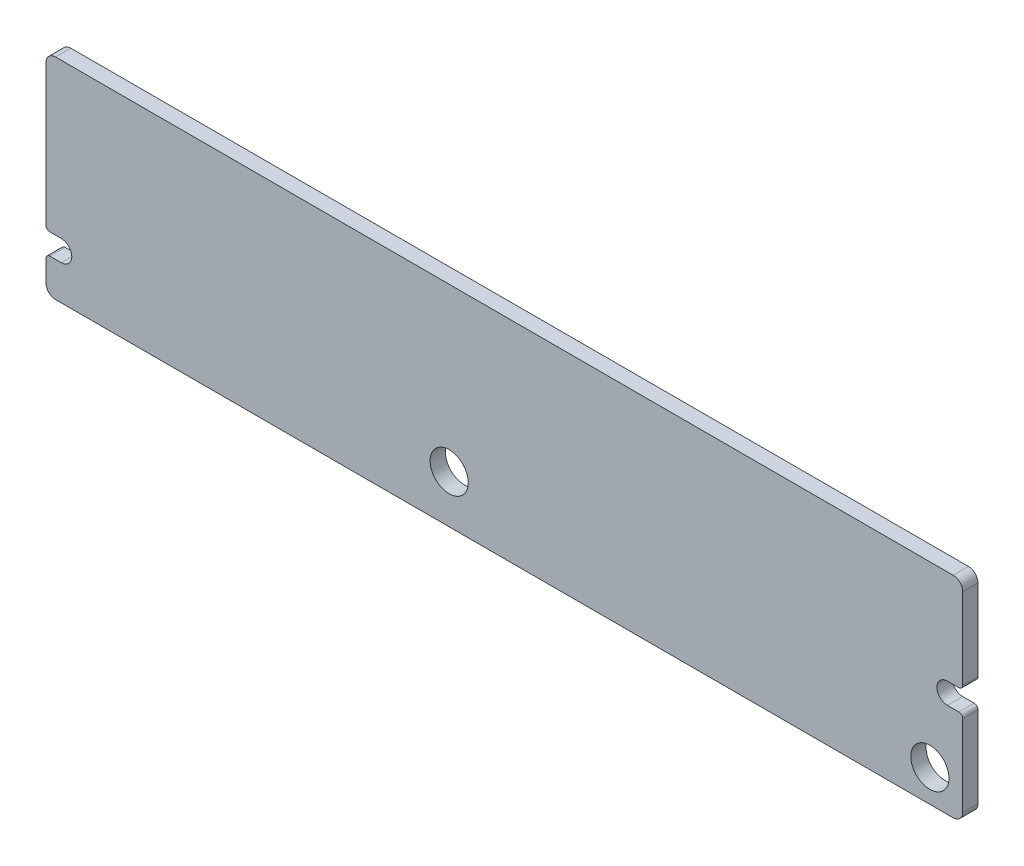
ISO-10303-21;
HEADER;
FILE_DESCRIPTION(('STEP AP214'),'2;1');
FILE_NAME('part.step','',(''),(''),'','','');
FILE_SCHEMA(('AUTOMOTIVE_DESIGN { 1 0 10303 214 1 1 1 1 }'));
ENDSEC;
DATA;
#1=APPLICATION_CONTEXT('core data for automotive mechanical design processes');
#2=APPLICATION_PROTOCOL_DEFINITION('international standard','automotive_design',2000,#1);
#3=PRODUCT_CONTEXT('',#1,'mechanical');
#4=PRODUCT('Part','Part','',(#3));
#5=PRODUCT_RELATED_PRODUCT_CATEGORY('part','',(#4));
#6=PRODUCT_DEFINITION_FORMATION('','',#4);
#7=PRODUCT_DEFINITION_CONTEXT('part definition',#1,'design');
#8=PRODUCT_DEFINITION('design','',#6,#7);
#9=PRODUCT_DEFINITION_SHAPE('','',#8);
#10=(LENGTH_UNIT() NAMED_UNIT(*) SI_UNIT(.MILLI.,.METRE.));
#11=(NAMED_UNIT(*) PLANE_ANGLE_UNIT() SI_UNIT($,.RADIAN.));
#12=(NAMED_UNIT(*) SI_UNIT($,.STERADIAN.) SOLID_ANGLE_UNIT());
#13=UNCERTAINTY_MEASURE_WITH_UNIT(LENGTH_MEASURE(1.E-05),#10,'distance_accuracy_value','');
#14=(GEOMETRIC_REPRESENTATION_CONTEXT(3) GLOBAL_UNCERTAINTY_ASSIGNED_CONTEXT((#13)) GLOBAL_UNIT_ASSIGNED_CONTEXT((#10,
#11,#12)) REPRESENTATION_CONTEXT('',''));
#15=CARTESIAN_POINT('',(0.,0.,0.));
#16=DIRECTION('',(0.,0.,1.));
#17=DIRECTION('',(1.,0.,0.));
#18=AXIS2_PLACEMENT_3D('',#15,#16,#17);
#19=CARTESIAN_POINT('',(-14.6,45.9499999999999,-4.46999999999998));
#20=DIRECTION('',(0.,0.,1.));
#21=DIRECTION('',(-1.,0.,0.));
#22=AXIS2_PLACEMENT_3D('',#19,#20,#21);
#23=PLANE('',#22);
#24=DIRECTION('',(-1.,0.,0.));
#25=VECTOR('',#24,1.);
#26=CARTESIAN_POINT('',(-19.8560525835406,1.02808763083835,-4.46999999999998));
#27=LINE('',#26,#25);
#28=CARTESIAN_POINT('',(-19.8560525835406,1.02808763083835,-4.46999999999998));
#29=VERTEX_POINT('',#28);
#30=CARTESIAN_POINT('',(-22.6530701818056,1.02808763083835,-4.46999999999998));
#31=VERTEX_POINT('',#30);
#32=EDGE_CURVE('E253',#29,#31,#27,.T.);
#33=ORIENTED_EDGE('',*,*,#32,.F.);
#34=DIRECTION('',(0.,-1.,0.));
#35=VECTOR('',#34,1.);
#36=CARTESIAN_POINT('',(-19.8560525835406,4.07937955621834,-4.46999999999998));
#37=LINE('',#36,#35);
#38=CARTESIAN_POINT('',(-19.8560525835406,4.07937955621834,-4.46999999999998));
#39=VERTEX_POINT('',#38);
#40=EDGE_CURVE('E284',#39,#29,#37,.T.);
#41=ORIENTED_EDGE('',*,*,#40,.F.);
#42=DIRECTION('',(-1.,0.,0.));
#43=VECTOR('',#42,1.);
#44=CARTESIAN_POINT('',(-19.8560525835406,4.07937955621834,-4.46999999999998));
#45=LINE('',#44,#43);
#46=CARTESIAN_POINT('',(-22.6530701818056,4.07937955621834,-4.46999999999998));
#47=VERTEX_POINT('',#46);
#48=EDGE_CURVE('E297',#39,#47,#45,.T.);
#49=ORIENTED_EDGE('',*,*,#48,.T.);
#50=DIRECTION('',(0.,-1.,0.));
#51=VECTOR('',#50,1.);
#52=CARTESIAN_POINT('',(-22.6530701818056,4.07937955621834,-4.46999999999998));
#53=LINE('',#52,#51);
#54=EDGE_CURVE('E295',#47,#31,#53,.T.);
#55=ORIENTED_EDGE('',*,*,#54,.T.);
#56=EDGE_LOOP('',(#33,#41,#49,#55));
#57=FACE_BOUND('',#56,.T.);
#58=CARTESIAN_POINT('',(-1.01999999999999,-0.720000000000151,-4.46999999999998));
#59=DIRECTION('',(0.,0.,-1.));
#60=DIRECTION('',(-1.,0.,0.));
#61=AXIS2_PLACEMENT_3D('',#58,#59,#60);
#62=CIRCLE('',#61,1.);
#63=CARTESIAN_POINT('',(-2.01999999999999,-0.720000000000151,-4.46999999999998));
#64=VERTEX_POINT('',#63);
#65=EDGE_CURVE('E375',#64,#64,#62,.T.);
#66=ORIENTED_EDGE('',*,*,#65,.F.);
#67=EDGE_LOOP('',(#66));
#68=FACE_BOUND('',#67,.T.);
#69=CARTESIAN_POINT('',(-26.19,0.0999999999998502,-4.46999999999998));
#70=DIRECTION('',(0.,0.,-1.));
#71=DIRECTION('',(-1.,0.,0.));
#72=AXIS2_PLACEMENT_3D('',#69,#70,#71);
#73=CIRCLE('',#72,1.);
#74=CARTESIAN_POINT('',(-27.19,0.0999999999998502,-4.46999999999998));
#75=VERTEX_POINT('',#74);
#76=EDGE_CURVE('E51',#75,#75,#73,.T.);
#77=ORIENTED_EDGE('',*,*,#76,.F.);
#78=EDGE_LOOP('',(#77));
#79=FACE_BOUND('',#78,.T.);
#80=DIRECTION('',(0.,-1.,0.));
#81=VECTOR('',#80,1.);
#82=CARTESIAN_POINT('',(-47.3,8.09999999999985,-4.46999999999998));
#83=LINE('',#82,#81);
#84=CARTESIAN_POINT('',(-47.3,8.09999999999985,-4.47));
#85=VERTEX_POINT('',#84);
#86=CARTESIAN_POINT('',(-47.3,0.719999999999853,-4.47));
#87=VERTEX_POINT('',#86);
#88=EDGE_CURVE('E459',#85,#87,#83,.T.);
#89=ORIENTED_EDGE('',*,*,#88,.F.);
#90=CARTESIAN_POINT('',(-46.8,8.09999999999985,-4.46999999999998));
#91=DIRECTION('',(0.,0.,-1.));
#92=DIRECTION('',(-1.,0.,0.));
#93=AXIS2_PLACEMENT_3D('',#90,#91,#92);
#94=CIRCLE('',#93,0.5);
#95=CARTESIAN_POINT('',(-46.8,8.59999999999985,-4.47));
#96=VERTEX_POINT('',#95);
#97=EDGE_CURVE('E312',#85,#96,#94,.T.);
#98=ORIENTED_EDGE('',*,*,#97,.T.);
#99=DIRECTION('',(-1.,0.,0.));
#100=VECTOR('',#99,1.);
#101=CARTESIAN_POINT('',(0.200000000000013,8.59999999999985,-4.46999999999998));
#102=LINE('',#101,#100);
#103=CARTESIAN_POINT('',(0.200000000000013,8.59999999999985,-4.47));
#104=VERTEX_POINT('',#103);
#105=EDGE_CURVE('E451',#104,#96,#102,.T.);
#106=ORIENTED_EDGE('',*,*,#105,.F.);
#107=CARTESIAN_POINT('',(0.200000000000013,8.09999999999985,-4.46999999999998));
#108=DIRECTION('',(0.,0.,-1.));
#109=DIRECTION('',(0.,1.,0.));
#110=AXIS2_PLACEMENT_3D('',#107,#108,#109);
#111=CIRCLE('',#110,0.5);
#112=CARTESIAN_POINT('',(0.700000000000011,8.09999999999985,-4.47));
#113=VERTEX_POINT('',#112);
#114=EDGE_CURVE('E442',#104,#113,#111,.T.);
#115=ORIENTED_EDGE('',*,*,#114,.T.);
#116=DIRECTION('',(0.,1.,0.));
#117=VECTOR('',#116,1.);
#118=CARTESIAN_POINT('',(0.700000000000011,3.84999999999985,-4.46999999999998));
#119=LINE('',#118,#117);
#120=CARTESIAN_POINT('',(0.700000000000011,3.84999999999985,-4.47));
#121=VERTEX_POINT('',#120);
#122=EDGE_CURVE('E443',#121,#113,#119,.T.);
#123=ORIENTED_EDGE('',*,*,#122,.F.);
#124=CARTESIAN_POINT('',(0.500000000000013,3.84999999999985,-4.46999999999998));
#125=DIRECTION('',(0.,0.,-1.));
#126=DIRECTION('',(1.,0.,0.));
#127=AXIS2_PLACEMENT_3D('',#124,#125,#126);
#128=CIRCLE('',#127,0.2);
#129=CARTESIAN_POINT('',(0.500000000000013,3.64999999999985,-4.47));
#130=VERTEX_POINT('',#129);
#131=EDGE_CURVE('E425',#121,#130,#128,.T.);
#132=ORIENTED_EDGE('',*,*,#131,.T.);
#133=DIRECTION('',(1.,0.,0.));
#134=VECTOR('',#133,1.);
#135=CARTESIAN_POINT('',(-0.0999999999999873,3.64999999999985,-4.46999999999998));
#136=LINE('',#135,#134);
#137=CARTESIAN_POINT('',(-0.0999999999999872,3.64999999999985,-4.47));
#138=VERTEX_POINT('',#137);
#139=EDGE_CURVE('E435',#138,#130,#136,.T.);
#140=ORIENTED_EDGE('',*,*,#139,.F.);
#141=CARTESIAN_POINT('',(-0.0999999999999873,3.09999999999985,-4.46999999999998));
#142=DIRECTION('',(0.,0.,-1.));
#143=DIRECTION('',(0.,-1.,0.));
#144=AXIS2_PLACEMENT_3D('',#141,#142,#143);
#145=CIRCLE('',#144,0.55);
#146=CARTESIAN_POINT('',(-0.0999999999999873,2.54999999999985,-4.47));
#147=VERTEX_POINT('',#146);
#148=EDGE_CURVE('E431',#147,#138,#145,.T.);
#149=ORIENTED_EDGE('',*,*,#148,.F.);
#150=DIRECTION('',(-1.,0.,0.));
#151=VECTOR('',#150,1.);
#152=CARTESIAN_POINT('',(0.500000000000013,2.54999999999985,-4.46999999999998));
#153=LINE('',#152,#151);
#154=CARTESIAN_POINT('',(0.500000000000013,2.54999999999985,-4.47));
#155=VERTEX_POINT('',#154);
#156=EDGE_CURVE('E426',#155,#147,#153,.T.);
#157=ORIENTED_EDGE('',*,*,#156,.F.);
#158=CARTESIAN_POINT('',(0.500000000000013,2.34999999999985,-4.46999999999998));
#159=DIRECTION('',(0.,0.,-1.));
#160=DIRECTION('',(0.,1.,0.));
#161=AXIS2_PLACEMENT_3D('',#158,#159,#160);
#162=CIRCLE('',#161,0.2);
#163=CARTESIAN_POINT('',(0.700000000000011,2.34999999999985,-4.47));
#164=VERTEX_POINT('',#163);
#165=EDGE_CURVE('E416',#155,#164,#162,.T.);
#166=ORIENTED_EDGE('',*,*,#165,.T.);
#167=DIRECTION('',(0.,1.,0.));
#168=VECTOR('',#167,1.);
#169=CARTESIAN_POINT('',(0.700000000000011,-1.90000000000014,-4.46999999999998));
#170=LINE('',#169,#168);
#171=CARTESIAN_POINT('',(0.700000000000012,-1.90000000000014,-4.47));
#172=VERTEX_POINT('',#171);
#173=EDGE_CURVE('E417',#172,#164,#170,.T.);
#174=ORIENTED_EDGE('',*,*,#173,.F.);
#175=CARTESIAN_POINT('',(0.200000000000013,-1.90000000000014,-4.46999999999998));
#176=DIRECTION('',(0.,0.,-1.));
#177=DIRECTION('',(1.,0.,0.));
#178=AXIS2_PLACEMENT_3D('',#175,#176,#177);
#179=CIRCLE('',#178,0.5);
#180=CARTESIAN_POINT('',(0.200000000000013,-2.40000000000015,-4.47));
#181=VERTEX_POINT('',#180);
#182=EDGE_CURVE('E407',#172,#181,#179,.T.);
#183=ORIENTED_EDGE('',*,*,#182,.T.);
#184=DIRECTION('',(1.,0.,0.));
#185=VECTOR('',#184,1.);
#186=CARTESIAN_POINT('',(-46.8,-2.40000000000015,-4.46999999999998));
#187=LINE('',#186,#185);
#188=CARTESIAN_POINT('',(-46.8,-2.40000000000015,-4.47));
#189=VERTEX_POINT('',#188);
#190=EDGE_CURVE('E408',#189,#181,#187,.T.);
#191=ORIENTED_EDGE('',*,*,#190,.F.);
#192=CARTESIAN_POINT('',(-46.8,-1.90000000000014,-4.46999999999998));
#193=DIRECTION('',(0.,0.,-1.));
#194=DIRECTION('',(0.,-1.,0.));
#195=AXIS2_PLACEMENT_3D('',#192,#193,#194);
#196=CIRCLE('',#195,0.5);
#197=CARTESIAN_POINT('',(-47.3,-1.90000000000014,-4.47));
#198=VERTEX_POINT('',#197);
#199=EDGE_CURVE('E398',#189,#198,#196,.T.);
#200=ORIENTED_EDGE('',*,*,#199,.T.);
#201=DIRECTION('',(0.,-1.,0.));
#202=VECTOR('',#201,1.);
#203=CARTESIAN_POINT('',(-47.3,-0.780000000000149,-4.46999999999998));
#204=LINE('',#203,#202);
#205=CARTESIAN_POINT('',(-47.3,-0.780000000000149,-4.47));
#206=VERTEX_POINT('',#205);
#207=EDGE_CURVE('E399',#206,#198,#204,.T.);
#208=ORIENTED_EDGE('',*,*,#207,.F.);
#209=CARTESIAN_POINT('',(-47.1,-0.780000000000149,-4.46999999999998));
#210=DIRECTION('',(0.,0.,-1.));
#211=DIRECTION('',(-1.,0.,0.));
#212=AXIS2_PLACEMENT_3D('',#209,#210,#211);
#213=CIRCLE('',#212,0.2);
#214=CARTESIAN_POINT('',(-47.1,-0.58000000000015,-4.47));
#215=VERTEX_POINT('',#214);
#216=EDGE_CURVE('E382',#206,#215,#213,.T.);
#217=ORIENTED_EDGE('',*,*,#216,.T.);
#218=DIRECTION('',(-1.,0.,0.));
#219=VECTOR('',#218,1.);
#220=CARTESIAN_POINT('',(-46.5,-0.58000000000015,-4.46999999999998));
#221=LINE('',#220,#219);
#222=CARTESIAN_POINT('',(-46.5,-0.58000000000015,-4.47));
#223=VERTEX_POINT('',#222);
#224=EDGE_CURVE('E391',#223,#215,#221,.T.);
#225=ORIENTED_EDGE('',*,*,#224,.F.);
#226=CARTESIAN_POINT('',(-46.5,-0.030000000000148,-4.46999999999998));
#227=DIRECTION('',(0.,0.,-1.));
#228=DIRECTION('',(0.,1.,0.));
#229=AXIS2_PLACEMENT_3D('',#226,#227,#228);
#230=CIRCLE('',#229,0.55);
#231=CARTESIAN_POINT('',(-46.5,0.519999999999854,-4.47));
#232=VERTEX_POINT('',#231);
#233=EDGE_CURVE('E387',#232,#223,#230,.T.);
#234=ORIENTED_EDGE('',*,*,#233,.F.);
#235=DIRECTION('',(1.,0.,0.));
#236=VECTOR('',#235,1.);
#237=CARTESIAN_POINT('',(-47.1,0.519999999999854,-4.46999999999998));
#238=LINE('',#237,#236);
#239=CARTESIAN_POINT('',(-47.1,0.519999999999854,-4.46999999999998));
#240=VERTEX_POINT('',#239);
#241=EDGE_CURVE('E381',#240,#232,#238,.T.);
#242=ORIENTED_EDGE('',*,*,#241,.F.);
#243=CARTESIAN_POINT('',(-47.1,0.719999999999853,-4.46999999999998));
#244=DIRECTION('',(0.,0.,-1.));
#245=DIRECTION('',(0.,-1.,0.));
#246=AXIS2_PLACEMENT_3D('',#243,#244,#245);
#247=CIRCLE('',#246,0.2);
#248=EDGE_CURVE('E377',#240,#87,#247,.T.);
#249=ORIENTED_EDGE('',*,*,#248,.T.);
#250=EDGE_LOOP('',(#89,#98,#106,#115,#123,#132,#140,#149,#157,#166,#174,#183,#191,#200,#208,
#217,#225,#234,#242,#249));
#251=FACE_BOUND('',#250,.T.);
#252=DIRECTION('',(-1.,0.,0.));
#253=VECTOR('',#252,1.);
#254=CARTESIAN_POINT('',(-26.3400479249731,1.36712006699169,-4.46999999999998));
#255=LINE('',#254,#253);
#256=CARTESIAN_POINT('',(-26.3400479249731,1.36712006699169,-4.46999999999998));
#257=VERTEX_POINT('',#256);
#258=CARTESIAN_POINT('',(-30.5567638496302,1.36712006699169,-4.46999999999998));
#259=VERTEX_POINT('',#258);
#260=EDGE_CURVE('E246',#257,#259,#255,.T.);
#261=ORIENTED_EDGE('',*,*,#260,.F.);
#262=DIRECTION('',(0.,-1.,0.));
#263=VECTOR('',#262,1.);
#264=CARTESIAN_POINT('',(-26.3400479249731,3.76153664732459,-4.46999999999998));
#265=LINE('',#264,#263);
#266=CARTESIAN_POINT('',(-26.3400479249731,3.76153664732459,-4.46999999999998));
#267=VERTEX_POINT('',#266);
#268=EDGE_CURVE('E248',#267,#257,#265,.T.);
#269=ORIENTED_EDGE('',*,*,#268,.F.);
#270=DIRECTION('',(-1.,0.,0.));
#271=VECTOR('',#270,1.);
#272=CARTESIAN_POINT('',(-26.3400479249731,3.76153664732459,-4.46999999999998));
#273=LINE('',#272,#271);
#274=CARTESIAN_POINT('',(-30.5567638496302,3.76153664732459,-4.46999999999998));
#275=VERTEX_POINT('',#274);
#276=EDGE_CURVE('E64',#267,#275,#273,.T.);
#277=ORIENTED_EDGE('',*,*,#276,.T.);
#278=DIRECTION('',(0.,-1.,0.));
#279=VECTOR('',#278,1.);
#280=CARTESIAN_POINT('',(-30.5567638496302,3.76153664732459,-4.46999999999998));
#281=LINE('',#280,#279);
#282=EDGE_CURVE('E59',#275,#259,#281,.T.);
#283=ORIENTED_EDGE('',*,*,#282,.T.);
#284=EDGE_LOOP('',(#261,#269,#277,#283));
#285=FACE_BOUND('',#284,.T.);
#286=ADVANCED_FACE('F43',(#57,#68,#79,#251,#285),#23,.F.);
#287=CARTESIAN_POINT('',(-47.1,0.519999999999854,-53.7142890089805));
#288=DIRECTION('',(0.,-1.,0.));
#289=DIRECTION('',(0.,0.,-1.));
#290=AXIS2_PLACEMENT_3D('',#287,#288,#289);
#291=PLANE('',#290);
#292=ORIENTED_EDGE('',*,*,#241,.T.);
#293=DIRECTION('',(0.,0.,1.));
#294=VECTOR('',#293,1.);
#295=CARTESIAN_POINT('',(-46.5,0.519999999999854,-53.7142890089805));
#296=LINE('',#295,#294);
#297=CARTESIAN_POINT('',(-46.5,0.519999999999854,-3.66999999999998));
#298=VERTEX_POINT('',#297);
#299=EDGE_CURVE('E386',#232,#298,#296,.T.);
#300=ORIENTED_EDGE('',*,*,#299,.T.);
#301=DIRECTION('',(1.,0.,0.));
#302=VECTOR('',#301,1.);
#303=CARTESIAN_POINT('',(-47.1,0.519999999999854,-3.66999999999998));
#304=LINE('',#303,#302);
#305=CARTESIAN_POINT('',(-47.1,0.519999999999854,-3.66999999999998));
#306=VERTEX_POINT('',#305);
#307=EDGE_CURVE('E367',#306,#298,#304,.T.);
#308=ORIENTED_EDGE('',*,*,#307,.F.);
#309=DIRECTION('',(0.,0.,1.));
#310=VECTOR('',#309,1.);
#311=CARTESIAN_POINT('',(-47.1,0.519999999999854,-53.7142890089805));
#312=LINE('',#311,#310);
#313=EDGE_CURVE('E46',#240,#306,#312,.T.);
#314=ORIENTED_EDGE('',*,*,#313,.F.);
#315=EDGE_LOOP('',(#292,#300,#308,#314));
#316=FACE_BOUND('',#315,.T.);
#317=ADVANCED_FACE('F490',(#316),#291,.T.);
#318=CARTESIAN_POINT('',(-46.5,-0.030000000000148,-53.7142890089805));
#319=DIRECTION('',(0.,0.,1.));
#320=DIRECTION('',(1.,0.,0.));
#321=AXIS2_PLACEMENT_3D('',#318,#319,#320);
#322=CYLINDRICAL_SURFACE('',#321,0.550000000000002);
#323=ORIENTED_EDGE('',*,*,#233,.T.);
#324=DIRECTION('',(0.,0.,1.));
#325=VECTOR('',#324,1.);
#326=CARTESIAN_POINT('',(-46.5,-0.58000000000015,-53.7142890089805));
#327=LINE('',#326,#325);
#328=CARTESIAN_POINT('',(-46.5,-0.58000000000015,-3.66999999999998));
#329=VERTEX_POINT('',#328);
#330=EDGE_CURVE('E390',#223,#329,#327,.T.);
#331=ORIENTED_EDGE('',*,*,#330,.T.);
#332=CARTESIAN_POINT('',(-46.5,-0.030000000000148,-3.66999999999998));
#333=DIRECTION('',(0.,0.,-1.));
#334=DIRECTION('',(1.,0.,0.));
#335=AXIS2_PLACEMENT_3D('',#332,#333,#334);
#336=CIRCLE('',#335,0.550000000000002);
#337=EDGE_CURVE('E364',#298,#329,#336,.T.);
#338=ORIENTED_EDGE('',*,*,#337,.F.);
#339=ORIENTED_EDGE('',*,*,#299,.F.);
#340=EDGE_LOOP('',(#323,#331,#338,#339));
#341=FACE_BOUND('',#340,.T.);
#342=ADVANCED_FACE('F494',(#341),#322,.F.);
#343=CARTESIAN_POINT('',(-46.5,-0.58000000000015,-53.7142890089805));
#344=DIRECTION('',(0.,1.,0.));
#345=DIRECTION('',(0.,0.,1.));
#346=AXIS2_PLACEMENT_3D('',#343,#344,#345);
#347=PLANE('',#346);
#348=ORIENTED_EDGE('',*,*,#224,.T.);
#349=DIRECTION('',(0.,0.,1.));
#350=VECTOR('',#349,1.);
#351=CARTESIAN_POINT('',(-47.1,-0.58000000000015,-53.7142890089805));
#352=LINE('',#351,#350);
#353=CARTESIAN_POINT('',(-47.1,-0.58000000000015,-3.66999999999998));
#354=VERTEX_POINT('',#353);
#355=EDGE_CURVE('E394',#215,#354,#352,.T.);
#356=ORIENTED_EDGE('',*,*,#355,.T.);
#357=DIRECTION('',(-1.,0.,0.));
#358=VECTOR('',#357,1.);
#359=CARTESIAN_POINT('',(-46.5,-0.58000000000015,-3.66999999999998));
#360=LINE('',#359,#358);
#361=EDGE_CURVE('E361',#329,#354,#360,.T.);
#362=ORIENTED_EDGE('',*,*,#361,.F.);
#363=ORIENTED_EDGE('',*,*,#330,.F.);
#364=EDGE_LOOP('',(#348,#356,#362,#363));
#365=FACE_BOUND('',#364,.T.);
#366=ADVANCED_FACE('F509',(#365),#347,.T.);
#367=CARTESIAN_POINT('',(-47.1,-0.780000000000149,-53.7142890089805));
#368=DIRECTION('',(0.,0.,1.));
#369=DIRECTION('',(1.,0.,0.));
#370=AXIS2_PLACEMENT_3D('',#367,#368,#369);
#371=CYLINDRICAL_SURFACE('',#370,0.199999999999999);
#372=ORIENTED_EDGE('',*,*,#216,.F.);
#373=DIRECTION('',(0.,0.,1.));
#374=VECTOR('',#373,1.);
#375=CARTESIAN_POINT('',(-47.3,-0.780000000000149,-53.7142890089805));
#376=LINE('',#375,#374);
#377=CARTESIAN_POINT('',(-47.3,-0.780000000000149,-3.66999999999998));
#378=VERTEX_POINT('',#377);
#379=EDGE_CURVE('E403',#206,#378,#376,.T.);
#380=ORIENTED_EDGE('',*,*,#379,.T.);
#381=CARTESIAN_POINT('',(-47.1,-0.780000000000149,-3.66999999999998));
#382=DIRECTION('',(0.,0.,1.));
#383=DIRECTION('',(1.,0.,0.));
#384=AXIS2_PLACEMENT_3D('',#381,#382,#383);
#385=CIRCLE('',#384,0.199999999999999);
#386=EDGE_CURVE('E358',#354,#378,#385,.T.);
#387=ORIENTED_EDGE('',*,*,#386,.F.);
#388=ORIENTED_EDGE('',*,*,#355,.F.);
#389=EDGE_LOOP('',(#372,#380,#387,#388));
#390=FACE_BOUND('',#389,.T.);
#391=ADVANCED_FACE('F514',(#390),#371,.T.);
#392=CARTESIAN_POINT('',(-47.3,-0.780000000000149,-53.7142890089805));
#393=DIRECTION('',(-1.,0.,0.));
#394=DIRECTION('',(0.,0.,1.));
#395=AXIS2_PLACEMENT_3D('',#392,#393,#394);
#396=PLANE('',#395);
#397=ORIENTED_EDGE('',*,*,#207,.T.);
#398=DIRECTION('',(0.,0.,1.));
#399=VECTOR('',#398,1.);
#400=CARTESIAN_POINT('',(-47.3,-1.90000000000014,-53.7142890089805));
#401=LINE('',#400,#399);
#402=CARTESIAN_POINT('',(-47.3,-1.90000000000014,-3.66999999999998));
#403=VERTEX_POINT('',#402);
#404=EDGE_CURVE('E402',#198,#403,#401,.T.);
#405=ORIENTED_EDGE('',*,*,#404,.T.);
#406=DIRECTION('',(0.,-1.,0.));
#407=VECTOR('',#406,1.);
#408=CARTESIAN_POINT('',(-47.3,-0.780000000000149,-3.66999999999998));
#409=LINE('',#408,#407);
#410=EDGE_CURVE('E355',#378,#403,#409,.T.);
#411=ORIENTED_EDGE('',*,*,#410,.F.);
#412=ORIENTED_EDGE('',*,*,#379,.F.);
#413=EDGE_LOOP('',(#397,#405,#411,#412));
#414=FACE_BOUND('',#413,.T.);
#415=ADVANCED_FACE('F518',(#414),#396,.T.);
#416=CARTESIAN_POINT('',(-46.8,-1.90000000000014,-53.7142890089805));
#417=DIRECTION('',(0.,0.,1.));
#418=DIRECTION('',(1.,0.,0.));
#419=AXIS2_PLACEMENT_3D('',#416,#417,#418);
#420=CYLINDRICAL_SURFACE('',#419,0.5);
#421=ORIENTED_EDGE('',*,*,#199,.F.);
#422=DIRECTION('',(0.,0.,1.));
#423=VECTOR('',#422,1.);
#424=CARTESIAN_POINT('',(-46.8,-2.40000000000015,-53.7142890089805));
#425=LINE('',#424,#423);
#426=CARTESIAN_POINT('',(-46.8,-2.40000000000015,-3.66999999999998));
#427=VERTEX_POINT('',#426);
#428=EDGE_CURVE('E412',#189,#427,#425,.T.);
#429=ORIENTED_EDGE('',*,*,#428,.T.);
#430=CARTESIAN_POINT('',(-46.8,-1.90000000000014,-3.66999999999998));
#431=DIRECTION('',(0.,0.,1.));
#432=DIRECTION('',(1.,0.,0.));
#433=AXIS2_PLACEMENT_3D('',#430,#431,#432);
#434=CIRCLE('',#433,0.5);
#435=EDGE_CURVE('E352',#403,#427,#434,.T.);
#436=ORIENTED_EDGE('',*,*,#435,.F.);
#437=ORIENTED_EDGE('',*,*,#404,.F.);
#438=EDGE_LOOP('',(#421,#429,#436,#437));
#439=FACE_BOUND('',#438,.T.);
#440=ADVANCED_FACE('F522',(#439),#420,.T.);
#441=CARTESIAN_POINT('',(-46.8,-2.40000000000015,-53.7142890089805));
#442=DIRECTION('',(0.,-1.,0.));
#443=DIRECTION('',(0.,0.,-1.));
#444=AXIS2_PLACEMENT_3D('',#441,#442,#443);
#445=PLANE('',#444);
#446=ORIENTED_EDGE('',*,*,#190,.T.);
#447=DIRECTION('',(0.,0.,1.));
#448=VECTOR('',#447,1.);
#449=CARTESIAN_POINT('',(0.200000000000013,-2.40000000000015,-53.7142890089805));
#450=LINE('',#449,#448);
#451=CARTESIAN_POINT('',(0.200000000000013,-2.40000000000015,-3.66999999999998));
#452=VERTEX_POINT('',#451);
#453=EDGE_CURVE('E411',#181,#452,#450,.T.);
#454=ORIENTED_EDGE('',*,*,#453,.T.);
#455=DIRECTION('',(1.,0.,0.));
#456=VECTOR('',#455,1.);
#457=CARTESIAN_POINT('',(-46.8,-2.40000000000015,-3.66999999999998));
#458=LINE('',#457,#456);
#459=EDGE_CURVE('E349',#427,#452,#458,.T.);
#460=ORIENTED_EDGE('',*,*,#459,.F.);
#461=ORIENTED_EDGE('',*,*,#428,.F.);
#462=EDGE_LOOP('',(#446,#454,#460,#461));
#463=FACE_BOUND('',#462,.T.);
#464=ADVANCED_FACE('F527',(#463),#445,.T.);
#465=CARTESIAN_POINT('',(0.200000000000013,-1.90000000000014,-53.7142890089805));
#466=DIRECTION('',(0.,0.,1.));
#467=DIRECTION('',(1.,0.,0.));
#468=AXIS2_PLACEMENT_3D('',#465,#466,#467);
#469=CYLINDRICAL_SURFACE('',#468,0.5);
#470=ORIENTED_EDGE('',*,*,#182,.F.);
#471=DIRECTION('',(0.,0.,1.));
#472=VECTOR('',#471,1.);
#473=CARTESIAN_POINT('',(0.700000000000012,-1.90000000000014,-53.7142890089805));
#474=LINE('',#473,#472);
#475=CARTESIAN_POINT('',(0.700000000000012,-1.90000000000014,-3.66999999999998));
#476=VERTEX_POINT('',#475);
#477=EDGE_CURVE('E421',#172,#476,#474,.T.);
#478=ORIENTED_EDGE('',*,*,#477,.T.);
#479=CARTESIAN_POINT('',(0.200000000000013,-1.90000000000014,-3.66999999999998));
#480=DIRECTION('',(0.,0.,1.));
#481=DIRECTION('',(1.,0.,0.));
#482=AXIS2_PLACEMENT_3D('',#479,#480,#481);
#483=CIRCLE('',#482,0.5);
#484=EDGE_CURVE('E346',#452,#476,#483,.T.);
#485=ORIENTED_EDGE('',*,*,#484,.F.);
#486=ORIENTED_EDGE('',*,*,#453,.F.);
#487=EDGE_LOOP('',(#470,#478,#485,#486));
#488=FACE_BOUND('',#487,.T.);
#489=ADVANCED_FACE('F531',(#488),#469,.T.);
#490=CARTESIAN_POINT('',(0.700000000000011,-1.90000000000014,-53.7142890089805));
#491=DIRECTION('',(1.,0.,0.));
#492=DIRECTION('',(0.,0.,-1.));
#493=AXIS2_PLACEMENT_3D('',#490,#491,#492);
#494=PLANE('',#493);
#495=ORIENTED_EDGE('',*,*,#173,.T.);
#496=DIRECTION('',(0.,0.,1.));
#497=VECTOR('',#496,1.);
#498=CARTESIAN_POINT('',(0.700000000000011,2.34999999999985,-53.7142890089805));
#499=LINE('',#498,#497);
#500=CARTESIAN_POINT('',(0.700000000000011,2.34999999999985,-3.66999999999998));
#501=VERTEX_POINT('',#500);
#502=EDGE_CURVE('E420',#164,#501,#499,.T.);
#503=ORIENTED_EDGE('',*,*,#502,.T.);
#504=DIRECTION('',(0.,1.,0.));
#505=VECTOR('',#504,1.);
#506=CARTESIAN_POINT('',(0.700000000000011,-1.90000000000014,-3.66999999999998));
#507=LINE('',#506,#505);
#508=EDGE_CURVE('E343',#476,#501,#507,.T.);
#509=ORIENTED_EDGE('',*,*,#508,.F.);
#510=ORIENTED_EDGE('',*,*,#477,.F.);
#511=EDGE_LOOP('',(#495,#503,#509,#510));
#512=FACE_BOUND('',#511,.T.);
#513=ADVANCED_FACE('F536',(#512),#494,.T.);
#514=CARTESIAN_POINT('',(0.500000000000013,2.34999999999985,-53.7142890089805));
#515=DIRECTION('',(0.,0.,1.));
#516=DIRECTION('',(1.,0.,0.));
#517=AXIS2_PLACEMENT_3D('',#514,#515,#516);
#518=CYLINDRICAL_SURFACE('',#517,0.199999999999999);
#519=ORIENTED_EDGE('',*,*,#165,.F.);
#520=DIRECTION('',(0.,0.,1.));
#521=VECTOR('',#520,1.);
#522=CARTESIAN_POINT('',(0.500000000000013,2.54999999999985,-53.7142890089805));
#523=LINE('',#522,#521);
#524=CARTESIAN_POINT('',(0.500000000000013,2.54999999999985,-3.66999999999998));
#525=VERTEX_POINT('',#524);
#526=EDGE_CURVE('E430',#155,#525,#523,.T.);
#527=ORIENTED_EDGE('',*,*,#526,.T.);
#528=CARTESIAN_POINT('',(0.500000000000013,2.34999999999985,-3.66999999999998));
#529=DIRECTION('',(0.,0.,1.));
#530=DIRECTION('',(1.,0.,0.));
#531=AXIS2_PLACEMENT_3D('',#528,#529,#530);
#532=CIRCLE('',#531,0.199999999999999);
#533=EDGE_CURVE('E340',#501,#525,#532,.T.);
#534=ORIENTED_EDGE('',*,*,#533,.F.);
#535=ORIENTED_EDGE('',*,*,#502,.F.);
#536=EDGE_LOOP('',(#519,#527,#534,#535));
#537=FACE_BOUND('',#536,.T.);
#538=ADVANCED_FACE('F541',(#537),#518,.T.);
#539=CARTESIAN_POINT('',(0.500000000000013,2.54999999999985,-53.7142890089805));
#540=DIRECTION('',(0.,1.,0.));
#541=DIRECTION('',(0.,0.,1.));
#542=AXIS2_PLACEMENT_3D('',#539,#540,#541);
#543=PLANE('',#542);
#544=ORIENTED_EDGE('',*,*,#156,.T.);
#545=DIRECTION('',(0.,0.,1.));
#546=VECTOR('',#545,1.);
#547=CARTESIAN_POINT('',(-0.0999999999999873,2.54999999999985,-53.7142890089805));
#548=LINE('',#547,#546);
#549=CARTESIAN_POINT('',(-0.0999999999999873,2.54999999999985,-3.66999999999998));
#550=VERTEX_POINT('',#549);
#551=EDGE_CURVE('E429',#147,#550,#548,.T.);
#552=ORIENTED_EDGE('',*,*,#551,.T.);
#553=DIRECTION('',(-1.,0.,0.));
#554=VECTOR('',#553,1.);
#555=CARTESIAN_POINT('',(0.500000000000013,2.54999999999985,-3.66999999999998));
#556=LINE('',#555,#554);
#557=EDGE_CURVE('E337',#525,#550,#556,.T.);
#558=ORIENTED_EDGE('',*,*,#557,.F.);
#559=ORIENTED_EDGE('',*,*,#526,.F.);
#560=EDGE_LOOP('',(#544,#552,#558,#559));
#561=FACE_BOUND('',#560,.T.);
#562=ADVANCED_FACE('F545',(#561),#543,.T.);
#563=CARTESIAN_POINT('',(-0.0999999999999873,3.09999999999985,-53.7142890089805));
#564=DIRECTION('',(0.,0.,1.));
#565=DIRECTION('',(1.,0.,0.));
#566=AXIS2_PLACEMENT_3D('',#563,#564,#565);
#567=CYLINDRICAL_SURFACE('',#566,0.550000000000002);
#568=ORIENTED_EDGE('',*,*,#148,.T.);
#569=DIRECTION('',(0.,0.,1.));
#570=VECTOR('',#569,1.);
#571=CARTESIAN_POINT('',(-0.0999999999999872,3.64999999999985,-53.7142890089805));
#572=LINE('',#571,#570);
#573=CARTESIAN_POINT('',(-0.0999999999999872,3.64999999999985,-3.66999999999998));
#574=VERTEX_POINT('',#573);
#575=EDGE_CURVE('E434',#138,#574,#572,.T.);
#576=ORIENTED_EDGE('',*,*,#575,.T.);
#577=CARTESIAN_POINT('',(-0.0999999999999873,3.09999999999985,-3.66999999999998));
#578=DIRECTION('',(0.,0.,-1.));
#579=DIRECTION('',(1.,0.,0.));
#580=AXIS2_PLACEMENT_3D('',#577,#578,#579);
#581=CIRCLE('',#580,0.550000000000002);
#582=EDGE_CURVE('E334',#550,#574,#581,.T.);
#583=ORIENTED_EDGE('',*,*,#582,.F.);
#584=ORIENTED_EDGE('',*,*,#551,.F.);
#585=EDGE_LOOP('',(#568,#576,#583,#584));
#586=FACE_BOUND('',#585,.T.);
#587=ADVANCED_FACE('F550',(#586),#567,.F.);
#588=CARTESIAN_POINT('',(-0.0999999999999873,3.64999999999985,-53.7142890089805));
#589=DIRECTION('',(0.,-1.,0.));
#590=DIRECTION('',(0.,0.,-1.));
#591=AXIS2_PLACEMENT_3D('',#588,#589,#590);
#592=PLANE('',#591);
#593=ORIENTED_EDGE('',*,*,#139,.T.);
#594=DIRECTION('',(0.,0.,1.));
#595=VECTOR('',#594,1.);
#596=CARTESIAN_POINT('',(0.500000000000013,3.64999999999985,-53.7142890089805));
#597=LINE('',#596,#595);
#598=CARTESIAN_POINT('',(0.500000000000013,3.64999999999985,-3.66999999999998));
#599=VERTEX_POINT('',#598);
#600=EDGE_CURVE('E438',#130,#599,#597,.T.);
#601=ORIENTED_EDGE('',*,*,#600,.T.);
#602=DIRECTION('',(1.,0.,0.));
#603=VECTOR('',#602,1.);
#604=CARTESIAN_POINT('',(-0.0999999999999873,3.64999999999985,-3.66999999999998));
#605=LINE('',#604,#603);
#606=EDGE_CURVE('E331',#574,#599,#605,.T.);
#607=ORIENTED_EDGE('',*,*,#606,.F.);
#608=ORIENTED_EDGE('',*,*,#575,.F.);
#609=EDGE_LOOP('',(#593,#601,#607,#608));
#610=FACE_BOUND('',#609,.T.);
#611=ADVANCED_FACE('F555',(#610),#592,.T.);
#612=CARTESIAN_POINT('',(0.500000000000013,3.84999999999985,-53.7142890089805));
#613=DIRECTION('',(0.,0.,1.));
#614=DIRECTION('',(1.,0.,0.));
#615=AXIS2_PLACEMENT_3D('',#612,#613,#614);
#616=CYLINDRICAL_SURFACE('',#615,0.199999999999999);
#617=ORIENTED_EDGE('',*,*,#131,.F.);
#618=DIRECTION('',(0.,0.,1.));
#619=VECTOR('',#618,1.);
#620=CARTESIAN_POINT('',(0.700000000000011,3.84999999999985,-53.7142890089805));
#621=LINE('',#620,#619);
#622=CARTESIAN_POINT('',(0.700000000000011,3.84999999999985,-3.66999999999998));
#623=VERTEX_POINT('',#622);
#624=EDGE_CURVE('E447',#121,#623,#621,.T.);
#625=ORIENTED_EDGE('',*,*,#624,.T.);
#626=CARTESIAN_POINT('',(0.500000000000013,3.84999999999985,-3.66999999999998));
#627=DIRECTION('',(0.,0.,1.));
#628=DIRECTION('',(1.,0.,0.));
#629=AXIS2_PLACEMENT_3D('',#626,#627,#628);
#630=CIRCLE('',#629,0.199999999999999);
#631=EDGE_CURVE('E328',#599,#623,#630,.T.);
#632=ORIENTED_EDGE('',*,*,#631,.F.);
#633=ORIENTED_EDGE('',*,*,#600,.F.);
#634=EDGE_LOOP('',(#617,#625,#632,#633));
#635=FACE_BOUND('',#634,.T.);
#636=ADVANCED_FACE('F559',(#635),#616,.T.);
#637=CARTESIAN_POINT('',(0.700000000000011,3.84999999999985,-53.7142890089805));
#638=DIRECTION('',(1.,0.,0.));
#639=DIRECTION('',(0.,0.,-1.));
#640=AXIS2_PLACEMENT_3D('',#637,#638,#639);
#641=PLANE('',#640);
#642=ORIENTED_EDGE('',*,*,#122,.T.);
#643=DIRECTION('',(0.,0.,1.));
#644=VECTOR('',#643,1.);
#645=CARTESIAN_POINT('',(0.700000000000011,8.09999999999985,-53.7142890089805));
#646=LINE('',#645,#644);
#647=CARTESIAN_POINT('',(0.700000000000011,8.09999999999985,-3.66999999999998));
#648=VERTEX_POINT('',#647);
#649=EDGE_CURVE('E446',#113,#648,#646,.T.);
#650=ORIENTED_EDGE('',*,*,#649,.T.);
#651=DIRECTION('',(0.,1.,0.));
#652=VECTOR('',#651,1.);
#653=CARTESIAN_POINT('',(0.700000000000011,3.84999999999985,-3.66999999999998));
#654=LINE('',#653,#652);
#655=EDGE_CURVE('E325',#623,#648,#654,.T.);
#656=ORIENTED_EDGE('',*,*,#655,.F.);
#657=ORIENTED_EDGE('',*,*,#624,.F.);
#658=EDGE_LOOP('',(#642,#650,#656,#657));
#659=FACE_BOUND('',#658,.T.);
#660=ADVANCED_FACE('F564',(#659),#641,.T.);
#661=CARTESIAN_POINT('',(0.200000000000013,8.09999999999985,-53.7142890089805));
#662=DIRECTION('',(0.,0.,1.));
#663=DIRECTION('',(1.,0.,0.));
#664=AXIS2_PLACEMENT_3D('',#661,#662,#663);
#665=CYLINDRICAL_SURFACE('',#664,0.5);
#666=ORIENTED_EDGE('',*,*,#114,.F.);
#667=DIRECTION('',(0.,0.,1.));
#668=VECTOR('',#667,1.);
#669=CARTESIAN_POINT('',(0.200000000000013,8.59999999999985,-53.7142890089805));
#670=LINE('',#669,#668);
#671=CARTESIAN_POINT('',(0.200000000000013,8.59999999999985,-3.66999999999998));
#672=VERTEX_POINT('',#671);
#673=EDGE_CURVE('E455',#104,#672,#670,.T.);
#674=ORIENTED_EDGE('',*,*,#673,.T.);
#675=CARTESIAN_POINT('',(0.200000000000013,8.09999999999985,-3.66999999999998));
#676=DIRECTION('',(0.,0.,1.));
#677=DIRECTION('',(1.,0.,0.));
#678=AXIS2_PLACEMENT_3D('',#675,#676,#677);
#679=CIRCLE('',#678,0.5);
#680=EDGE_CURVE('E322',#648,#672,#679,.T.);
#681=ORIENTED_EDGE('',*,*,#680,.F.);
#682=ORIENTED_EDGE('',*,*,#649,.F.);
#683=EDGE_LOOP('',(#666,#674,#681,#682));
#684=FACE_BOUND('',#683,.T.);
#685=ADVANCED_FACE('F569',(#684),#665,.T.);
#686=CARTESIAN_POINT('',(0.200000000000013,8.59999999999985,-53.7142890089805));
#687=DIRECTION('',(0.,1.,0.));
#688=DIRECTION('',(0.,0.,1.));
#689=AXIS2_PLACEMENT_3D('',#686,#687,#688);
#690=PLANE('',#689);
#691=ORIENTED_EDGE('',*,*,#105,.T.);
#692=DIRECTION('',(0.,0.,1.));
#693=VECTOR('',#692,1.);
#694=CARTESIAN_POINT('',(-46.8,8.59999999999985,-53.7142890089805));
#695=LINE('',#694,#693);
#696=CARTESIAN_POINT('',(-46.8,8.59999999999985,-3.66999999999998));
#697=VERTEX_POINT('',#696);
#698=EDGE_CURVE('E454',#96,#697,#695,.T.);
#699=ORIENTED_EDGE('',*,*,#698,.T.);
#700=DIRECTION('',(-1.,0.,0.));
#701=VECTOR('',#700,1.);
#702=CARTESIAN_POINT('',(0.200000000000013,8.59999999999985,-3.66999999999998));
#703=LINE('',#702,#701);
#704=EDGE_CURVE('E319',#672,#697,#703,.T.);
#705=ORIENTED_EDGE('',*,*,#704,.F.);
#706=ORIENTED_EDGE('',*,*,#673,.F.);
#707=EDGE_LOOP('',(#691,#699,#705,#706));
#708=FACE_BOUND('',#707,.T.);
#709=ADVANCED_FACE('F573',(#708),#690,.T.);
#710=CARTESIAN_POINT('',(-46.8,8.09999999999985,-53.7142890089805));
#711=DIRECTION('',(0.,0.,1.));
#712=DIRECTION('',(1.,0.,0.));
#713=AXIS2_PLACEMENT_3D('',#710,#711,#712);
#714=CYLINDRICAL_SURFACE('',#713,0.5);
#715=ORIENTED_EDGE('',*,*,#97,.F.);
#716=DIRECTION('',(0.,0.,1.));
#717=VECTOR('',#716,1.);
#718=CARTESIAN_POINT('',(-47.3,8.09999999999985,-53.7142890089805));
#719=LINE('',#718,#717);
#720=CARTESIAN_POINT('',(-47.3,8.09999999999985,-3.66999999999998));
#721=VERTEX_POINT('',#720);
#722=EDGE_CURVE('E463',#85,#721,#719,.T.);
#723=ORIENTED_EDGE('',*,*,#722,.T.);
#724=CARTESIAN_POINT('',(-46.8,8.09999999999985,-3.66999999999998));
#725=DIRECTION('',(0.,0.,1.));
#726=DIRECTION('',(1.,0.,0.));
#727=AXIS2_PLACEMENT_3D('',#724,#725,#726);
#728=CIRCLE('',#727,0.5);
#729=EDGE_CURVE('E316',#697,#721,#728,.T.);
#730=ORIENTED_EDGE('',*,*,#729,.F.);
#731=ORIENTED_EDGE('',*,*,#698,.F.);
#732=EDGE_LOOP('',(#715,#723,#730,#731));
#733=FACE_BOUND('',#732,.T.);
#734=ADVANCED_FACE('F577',(#733),#714,.T.);
#735=CARTESIAN_POINT('',(-47.3,8.09999999999985,-53.7142890089805));
#736=DIRECTION('',(-1.,0.,0.));
#737=DIRECTION('',(0.,0.,1.));
#738=AXIS2_PLACEMENT_3D('',#735,#736,#737);
#739=PLANE('',#738);
#740=ORIENTED_EDGE('',*,*,#88,.T.);
#741=DIRECTION('',(0.,0.,1.));
#742=VECTOR('',#741,1.);
#743=CARTESIAN_POINT('',(-47.3,0.719999999999853,-53.7142890089805));
#744=LINE('',#743,#742);
#745=CARTESIAN_POINT('',(-47.3,0.719999999999853,-3.66999999999998));
#746=VERTEX_POINT('',#745);
#747=EDGE_CURVE('E462',#87,#746,#744,.T.);
#748=ORIENTED_EDGE('',*,*,#747,.T.);
#749=DIRECTION('',(0.,-1.,0.));
#750=VECTOR('',#749,1.);
#751=CARTESIAN_POINT('',(-47.3,8.09999999999985,-3.66999999999998));
#752=LINE('',#751,#750);
#753=EDGE_CURVE('E313',#721,#746,#752,.T.);
#754=ORIENTED_EDGE('',*,*,#753,.F.);
#755=ORIENTED_EDGE('',*,*,#722,.F.);
#756=EDGE_LOOP('',(#740,#748,#754,#755));
#757=FACE_BOUND('',#756,.T.);
#758=ADVANCED_FACE('F580',(#757),#739,.T.);
#759=CARTESIAN_POINT('',(-47.1,0.719999999999853,-53.7142890089805));
#760=DIRECTION('',(0.,0.,1.));
#761=DIRECTION('',(1.,0.,0.));
#762=AXIS2_PLACEMENT_3D('',#759,#760,#761);
#763=CYLINDRICAL_SURFACE('',#762,0.199999999999999);
#764=ORIENTED_EDGE('',*,*,#248,.F.);
#765=ORIENTED_EDGE('',*,*,#313,.T.);
#766=CARTESIAN_POINT('',(-47.1,0.719999999999853,-3.66999999999998));
#767=DIRECTION('',(0.,0.,1.));
#768=DIRECTION('',(1.,0.,0.));
#769=AXIS2_PLACEMENT_3D('',#766,#767,#768);
#770=CIRCLE('',#769,0.199999999999999);
#771=EDGE_CURVE('E370',#746,#306,#770,.T.);
#772=ORIENTED_EDGE('',*,*,#771,.F.);
#773=ORIENTED_EDGE('',*,*,#747,.F.);
#774=EDGE_LOOP('',(#764,#765,#772,#773));
#775=FACE_BOUND('',#774,.T.);
#776=ADVANCED_FACE('F504',(#775),#763,.T.);
#777=CARTESIAN_POINT('',(-1.01999999999999,-0.720000000000151,-53.7142890089805));
#778=DIRECTION('',(0.,0.,1.));
#779=DIRECTION('',(1.,0.,0.));
#780=AXIS2_PLACEMENT_3D('',#777,#778,#779);
#781=CYLINDRICAL_SURFACE('',#780,1.);
#782=ORIENTED_EDGE('',*,*,#65,.T.);
#783=EDGE_LOOP('',(#782));
#784=FACE_BOUND('',#783,.T.);
#785=CARTESIAN_POINT('',(-1.01999999999999,-0.720000000000151,-3.66999999999998));
#786=DIRECTION('',(0.,0.,1.));
#787=DIRECTION('',(1.,0.,0.));
#788=AXIS2_PLACEMENT_3D('',#785,#786,#787);
#789=CIRCLE('',#788,1.);
#790=CARTESIAN_POINT('',(-0.0199999999999879,-0.720000000000151,-3.66999999999998));
#791=VERTEX_POINT('',#790);
#792=EDGE_CURVE('E373',#791,#791,#789,.T.);
#793=ORIENTED_EDGE('',*,*,#792,.T.);
#794=EDGE_LOOP('',(#793));
#795=FACE_BOUND('',#794,.T.);
#796=ADVANCED_FACE('F587',(#784,#795),#781,.F.);
#797=CARTESIAN_POINT('',(-47.1,0.719999999999853,-3.66999999999998));
#798=DIRECTION('',(0.,0.,1.));
#799=DIRECTION('',(1.,0.,0.));
#800=AXIS2_PLACEMENT_3D('',#797,#798,#799);
#801=PLANE('',#800);
#802=CARTESIAN_POINT('',(-26.19,0.0999999999998502,-3.66999999999998));
#803=DIRECTION('',(0.,0.,1.));
#804=DIRECTION('',(1.,0.,0.));
#805=AXIS2_PLACEMENT_3D('',#802,#803,#804);
#806=CIRCLE('',#805,0.999999999999999);
#807=CARTESIAN_POINT('',(-25.19,0.0999999999998502,-3.66999999999998));
#808=VERTEX_POINT('',#807);
#809=EDGE_CURVE('E11',#808,#808,#806,.T.);
#810=ORIENTED_EDGE('',*,*,#809,.F.);
#811=EDGE_LOOP('',(#810));
#812=FACE_BOUND('',#811,.T.);
#813=ORIENTED_EDGE('',*,*,#792,.F.);
#814=EDGE_LOOP('',(#813));
#815=FACE_BOUND('',#814,.T.);
#816=ORIENTED_EDGE('',*,*,#771,.T.);
#817=ORIENTED_EDGE('',*,*,#307,.T.);
#818=ORIENTED_EDGE('',*,*,#337,.T.);
#819=ORIENTED_EDGE('',*,*,#361,.T.);
#820=ORIENTED_EDGE('',*,*,#386,.T.);
#821=ORIENTED_EDGE('',*,*,#410,.T.);
#822=ORIENTED_EDGE('',*,*,#435,.T.);
#823=ORIENTED_EDGE('',*,*,#459,.T.);
#824=ORIENTED_EDGE('',*,*,#484,.T.);
#825=ORIENTED_EDGE('',*,*,#508,.T.);
#826=ORIENTED_EDGE('',*,*,#533,.T.);
#827=ORIENTED_EDGE('',*,*,#557,.T.);
#828=ORIENTED_EDGE('',*,*,#582,.T.);
#829=ORIENTED_EDGE('',*,*,#606,.T.);
#830=ORIENTED_EDGE('',*,*,#631,.T.);
#831=ORIENTED_EDGE('',*,*,#655,.T.);
#832=ORIENTED_EDGE('',*,*,#680,.T.);
#833=ORIENTED_EDGE('',*,*,#704,.T.);
#834=ORIENTED_EDGE('',*,*,#729,.T.);
#835=ORIENTED_EDGE('',*,*,#753,.T.);
#836=EDGE_LOOP('',(#816,#817,#818,#819,#820,#821,#822,#823,#824,#825,#826,#827,#828,#829,#830,
#831,#832,#833,#834,#835));
#837=FACE_BOUND('',#836,.T.);
#838=ADVANCED_FACE('F498',(#812,#815,#837),#801,.T.);
#839=CARTESIAN_POINT('',(-26.19,0.0999999999998502,-53.7142890089805));
#840=DIRECTION('',(0.,0.,1.));
#841=DIRECTION('',(1.,0.,0.));
#842=AXIS2_PLACEMENT_3D('',#839,#840,#841);
#843=CYLINDRICAL_SURFACE('',#842,0.999999999999999);
#844=ORIENTED_EDGE('',*,*,#76,.T.);
#845=EDGE_LOOP('',(#844));
#846=FACE_BOUND('',#845,.T.);
#847=ORIENTED_EDGE('',*,*,#809,.T.);
#848=EDGE_LOOP('',(#847));
#849=FACE_BOUND('',#848,.T.);
#850=ADVANCED_FACE('F603',(#846,#849),#843,.F.);
#851=CARTESIAN_POINT('',(-19.8560525835406,1.02808763083835,-5.96999999999998));
#852=DIRECTION('',(0.,1.,0.));
#853=DIRECTION('',(0.,0.,1.));
#854=AXIS2_PLACEMENT_3D('',#851,#852,#853);
#855=PLANE('',#854);
#856=ORIENTED_EDGE('',*,*,#32,.T.);
#857=DIRECTION('',(0.,0.,1.));
#858=VECTOR('',#857,1.);
#859=CARTESIAN_POINT('',(-22.6530701818056,1.02808763083835,-5.96999999999998));
#860=LINE('',#859,#858);
#861=CARTESIAN_POINT('',(-22.6530701818056,1.02808763083835,-5.96999999999998));
#862=VERTEX_POINT('',#861);
#863=EDGE_CURVE('E309',#862,#31,#860,.T.);
#864=ORIENTED_EDGE('',*,*,#863,.F.);
#865=DIRECTION('',(-1.,0.,0.));
#866=VECTOR('',#865,1.);
#867=CARTESIAN_POINT('',(-19.8560525835406,1.02808763083835,-5.96999999999998));
#868=LINE('',#867,#866);
#869=CARTESIAN_POINT('',(-19.8560525835406,1.02808763083835,-5.96999999999998));
#870=VERTEX_POINT('',#869);
#871=EDGE_CURVE('E281',#870,#862,#868,.T.);
#872=ORIENTED_EDGE('',*,*,#871,.F.);
#873=DIRECTION('',(0.,0.,1.));
#874=VECTOR('',#873,1.);
#875=CARTESIAN_POINT('',(-19.8560525835406,1.02808763083835,-5.96999999999998));
#876=LINE('',#875,#874);
#877=EDGE_CURVE('E292',#870,#29,#876,.T.);
#878=ORIENTED_EDGE('',*,*,#877,.T.);
#879=EDGE_LOOP('',(#856,#864,#872,#878));
#880=FACE_BOUND('',#879,.T.);
#881=ADVANCED_FACE('F605',(#880),#855,.F.);
#882=CARTESIAN_POINT('',(-22.6530701818056,4.07937955621834,-5.96999999999998));
#883=DIRECTION('',(-1.,0.,0.));
#884=DIRECTION('',(0.,0.,1.));
#885=AXIS2_PLACEMENT_3D('',#882,#883,#884);
#886=PLANE('',#885);
#887=ORIENTED_EDGE('',*,*,#54,.F.);
#888=DIRECTION('',(0.,0.,1.));
#889=VECTOR('',#888,1.);
#890=CARTESIAN_POINT('',(-22.6530701818056,4.07937955621834,-5.96999999999998));
#891=LINE('',#890,#889);
#892=CARTESIAN_POINT('',(-22.6530701818056,4.07937955621834,-5.96999999999998));
#893=VERTEX_POINT('',#892);
#894=EDGE_CURVE('E306',#893,#47,#891,.T.);
#895=ORIENTED_EDGE('',*,*,#894,.F.);
#896=DIRECTION('',(0.,-1.,0.));
#897=VECTOR('',#896,1.);
#898=CARTESIAN_POINT('',(-22.6530701818056,4.07937955621834,-5.96999999999998));
#899=LINE('',#898,#897);
#900=EDGE_CURVE('E283',#893,#862,#899,.T.);
#901=ORIENTED_EDGE('',*,*,#900,.T.);
#902=ORIENTED_EDGE('',*,*,#863,.T.);
#903=EDGE_LOOP('',(#887,#895,#901,#902));
#904=FACE_BOUND('',#903,.T.);
#905=ADVANCED_FACE('F705',(#904),#886,.T.);
#906=CARTESIAN_POINT('',(-19.8560525835406,4.07937955621834,-5.96999999999998));
#907=DIRECTION('',(0.,1.,0.));
#908=DIRECTION('',(0.,0.,1.));
#909=AXIS2_PLACEMENT_3D('',#906,#907,#908);
#910=PLANE('',#909);
#911=ORIENTED_EDGE('',*,*,#48,.F.);
#912=DIRECTION('',(0.,0.,1.));
#913=VECTOR('',#912,1.);
#914=CARTESIAN_POINT('',(-19.8560525835406,4.07937955621834,-5.96999999999998));
#915=LINE('',#914,#913);
#916=CARTESIAN_POINT('',(-19.8560525835406,4.07937955621834,-5.96999999999998));
#917=VERTEX_POINT('',#916);
#918=EDGE_CURVE('E303',#917,#39,#915,.T.);
#919=ORIENTED_EDGE('',*,*,#918,.F.);
#920=DIRECTION('',(-1.,0.,0.));
#921=VECTOR('',#920,1.);
#922=CARTESIAN_POINT('',(-19.8560525835406,4.07937955621834,-5.96999999999998));
#923=LINE('',#922,#921);
#924=EDGE_CURVE('E287',#917,#893,#923,.T.);
#925=ORIENTED_EDGE('',*,*,#924,.T.);
#926=ORIENTED_EDGE('',*,*,#894,.T.);
#927=EDGE_LOOP('',(#911,#919,#925,#926));
#928=FACE_BOUND('',#927,.T.);
#929=ADVANCED_FACE('F715',(#928),#910,.T.);
#930=CARTESIAN_POINT('',(-19.8560525835406,4.07937955621834,-5.96999999999998));
#931=DIRECTION('',(-1.,0.,0.));
#932=DIRECTION('',(0.,0.,1.));
#933=AXIS2_PLACEMENT_3D('',#930,#931,#932);
#934=PLANE('',#933);
#935=ORIENTED_EDGE('',*,*,#40,.T.);
#936=ORIENTED_EDGE('',*,*,#877,.F.);
#937=DIRECTION('',(0.,-1.,0.));
#938=VECTOR('',#937,1.);
#939=CARTESIAN_POINT('',(-19.8560525835406,4.07937955621834,-5.96999999999998));
#940=LINE('',#939,#938);
#941=EDGE_CURVE('E290',#917,#870,#940,.T.);
#942=ORIENTED_EDGE('',*,*,#941,.F.);
#943=ORIENTED_EDGE('',*,*,#918,.T.);
#944=EDGE_LOOP('',(#935,#936,#942,#943));
#945=FACE_BOUND('',#944,.T.);
#946=ADVANCED_FACE('F725',(#945),#934,.F.);
#947=CARTESIAN_POINT('',(0.,0.,-5.96999999999998));
#948=DIRECTION('',(0.,0.,1.));
#949=DIRECTION('',(1.,0.,0.));
#950=AXIS2_PLACEMENT_3D('',#947,#948,#949);
#951=PLANE('',#950);
#952=ORIENTED_EDGE('',*,*,#871,.T.);
#953=ORIENTED_EDGE('',*,*,#900,.F.);
#954=ORIENTED_EDGE('',*,*,#924,.F.);
#955=ORIENTED_EDGE('',*,*,#941,.T.);
#956=EDGE_LOOP('',(#952,#953,#954,#955));
#957=FACE_BOUND('',#956,.T.);
#958=ADVANCED_FACE('F735',(#957),#951,.F.);
#959=CARTESIAN_POINT('',(-26.3400479249731,1.36712006699169,-5.96999999999998));
#960=DIRECTION('',(0.,1.,0.));
#961=DIRECTION('',(0.,0.,1.));
#962=AXIS2_PLACEMENT_3D('',#959,#960,#961);
#963=PLANE('',#962);
#964=ORIENTED_EDGE('',*,*,#260,.T.);
#965=DIRECTION('',(0.,0.,1.));
#966=VECTOR('',#965,1.);
#967=CARTESIAN_POINT('',(-30.5567638496302,1.36712006699169,-5.96999999999998));
#968=LINE('',#967,#966);
#969=CARTESIAN_POINT('',(-30.5567638496302,1.36712006699169,-5.96999999999998));
#970=VERTEX_POINT('',#969);
#971=EDGE_CURVE('E796',#970,#259,#968,.T.);
#972=ORIENTED_EDGE('',*,*,#971,.F.);
#973=DIRECTION('',(-1.,0.,0.));
#974=VECTOR('',#973,1.);
#975=CARTESIAN_POINT('',(-26.3400479249731,1.36712006699169,-5.96999999999998));
#976=LINE('',#975,#974);
#977=CARTESIAN_POINT('',(-26.3400479249731,1.36712006699169,-5.96999999999998));
#978=VERTEX_POINT('',#977);
#979=EDGE_CURVE('E262',#978,#970,#976,.T.);
#980=ORIENTED_EDGE('',*,*,#979,.F.);
#981=DIRECTION('',(0.,0.,1.));
#982=VECTOR('',#981,1.);
#983=CARTESIAN_POINT('',(-26.3400479249731,1.36712006699169,-5.96999999999998));
#984=LINE('',#983,#982);
#985=EDGE_CURVE('E259',#978,#257,#984,.T.);
#986=ORIENTED_EDGE('',*,*,#985,.T.);
#987=EDGE_LOOP('',(#964,#972,#980,#986));
#988=FACE_BOUND('',#987,.T.);
#989=ADVANCED_FACE('F264',(#988),#963,.F.);
#990=CARTESIAN_POINT('',(-30.5567638496302,3.76153664732459,-5.96999999999998));
#991=DIRECTION('',(-1.,0.,0.));
#992=DIRECTION('',(0.,0.,1.));
#993=AXIS2_PLACEMENT_3D('',#990,#991,#992);
#994=PLANE('',#993);
#995=ORIENTED_EDGE('',*,*,#282,.F.);
#996=DIRECTION('',(0.,0.,1.));
#997=VECTOR('',#996,1.);
#998=CARTESIAN_POINT('',(-30.5567638496302,3.76153664732459,-5.96999999999998));
#999=LINE('',#998,#997);
#1000=CARTESIAN_POINT('',(-30.5567638496302,3.76153664732459,-5.96999999999998));
#1001=VERTEX_POINT('',#1000);
#1002=EDGE_CURVE('E269',#1001,#275,#999,.T.);
#1003=ORIENTED_EDGE('',*,*,#1002,.F.);
#1004=DIRECTION('',(0.,-1.,0.));
#1005=VECTOR('',#1004,1.);
#1006=CARTESIAN_POINT('',(-30.5567638496302,3.76153664732459,-5.96999999999998));
#1007=LINE('',#1006,#1005);
#1008=EDGE_CURVE('E277',#1001,#970,#1007,.T.);
#1009=ORIENTED_EDGE('',*,*,#1008,.T.);
#1010=ORIENTED_EDGE('',*,*,#971,.T.);
#1011=EDGE_LOOP('',(#995,#1003,#1009,#1010));
#1012=FACE_BOUND('',#1011,.T.);
#1013=ADVANCED_FACE('F754',(#1012),#994,.T.);
#1014=CARTESIAN_POINT('',(-26.3400479249731,3.76153664732459,-5.96999999999998));
#1015=DIRECTION('',(0.,1.,0.));
#1016=DIRECTION('',(0.,0.,1.));
#1017=AXIS2_PLACEMENT_3D('',#1014,#1015,#1016);
#1018=PLANE('',#1017);
#1019=ORIENTED_EDGE('',*,*,#276,.F.);
#1020=DIRECTION('',(0.,0.,1.));
#1021=VECTOR('',#1020,1.);
#1022=CARTESIAN_POINT('',(-26.3400479249731,3.76153664732459,-5.96999999999998));
#1023=LINE('',#1022,#1021);
#1024=CARTESIAN_POINT('',(-26.3400479249731,3.76153664732459,-5.96999999999998));
#1025=VERTEX_POINT('',#1024);
#1026=EDGE_CURVE('E261',#1025,#267,#1023,.T.);
#1027=ORIENTED_EDGE('',*,*,#1026,.F.);
#1028=DIRECTION('',(-1.,0.,0.));
#1029=VECTOR('',#1028,1.);
#1030=CARTESIAN_POINT('',(-26.3400479249731,3.76153664732459,-5.96999999999998));
#1031=LINE('',#1030,#1029);
#1032=EDGE_CURVE('E267',#1025,#1001,#1031,.T.);
#1033=ORIENTED_EDGE('',*,*,#1032,.T.);
#1034=ORIENTED_EDGE('',*,*,#1002,.T.);
#1035=EDGE_LOOP('',(#1019,#1027,#1033,#1034));
#1036=FACE_BOUND('',#1035,.T.);
#1037=ADVANCED_FACE('F763',(#1036),#1018,.T.);
#1038=CARTESIAN_POINT('',(-26.3400479249731,3.76153664732459,-5.96999999999998));
#1039=DIRECTION('',(-1.,0.,0.));
#1040=DIRECTION('',(0.,0.,1.));
#1041=AXIS2_PLACEMENT_3D('',#1038,#1039,#1040);
#1042=PLANE('',#1041);
#1043=ORIENTED_EDGE('',*,*,#268,.T.);
#1044=ORIENTED_EDGE('',*,*,#985,.F.);
#1045=DIRECTION('',(0.,-1.,0.));
#1046=VECTOR('',#1045,1.);
#1047=CARTESIAN_POINT('',(-26.3400479249731,3.76153664732459,-5.96999999999998));
#1048=LINE('',#1047,#1046);
#1049=EDGE_CURVE('E265',#1025,#978,#1048,.T.);
#1050=ORIENTED_EDGE('',*,*,#1049,.F.);
#1051=ORIENTED_EDGE('',*,*,#1026,.T.);
#1052=EDGE_LOOP('',(#1043,#1044,#1050,#1051));
#1053=FACE_BOUND('',#1052,.T.);
#1054=ADVANCED_FACE('F257',(#1053),#1042,.F.);
#1055=CARTESIAN_POINT('',(0.,0.,-5.96999999999998));
#1056=DIRECTION('',(0.,0.,1.));
#1057=DIRECTION('',(1.,0.,0.));
#1058=AXIS2_PLACEMENT_3D('',#1055,#1056,#1057);
#1059=PLANE('',#1058);
#1060=ORIENTED_EDGE('',*,*,#979,.T.);
#1061=ORIENTED_EDGE('',*,*,#1008,.F.);
#1062=ORIENTED_EDGE('',*,*,#1032,.F.);
#1063=ORIENTED_EDGE('',*,*,#1049,.T.);
#1064=EDGE_LOOP('',(#1060,#1061,#1062,#1063));
#1065=FACE_BOUND('',#1064,.T.);
#1066=ADVANCED_FACE('F782',(#1065),#1059,.F.);
#1067=CLOSED_SHELL('',(#286,#317,#342,#366,#391,#415,#440,#464,#489,#513,#538,#562,#587,#611,
#636,#660,#685,#709,#734,#758,#776,#796,#838,#850,#881,#905,#929,#946,#958,#989,#1013,#1037,
#1054,#1066));
#1068=MANIFOLD_SOLID_BREP('B2',#1067);
#1069=ADVANCED_BREP_SHAPE_REPRESENTATION('',(#18,#1068),#14);
#1070=SHAPE_DEFINITION_REPRESENTATION(#9,#1069);
ENDSEC;
END-ISO-10303-21;
